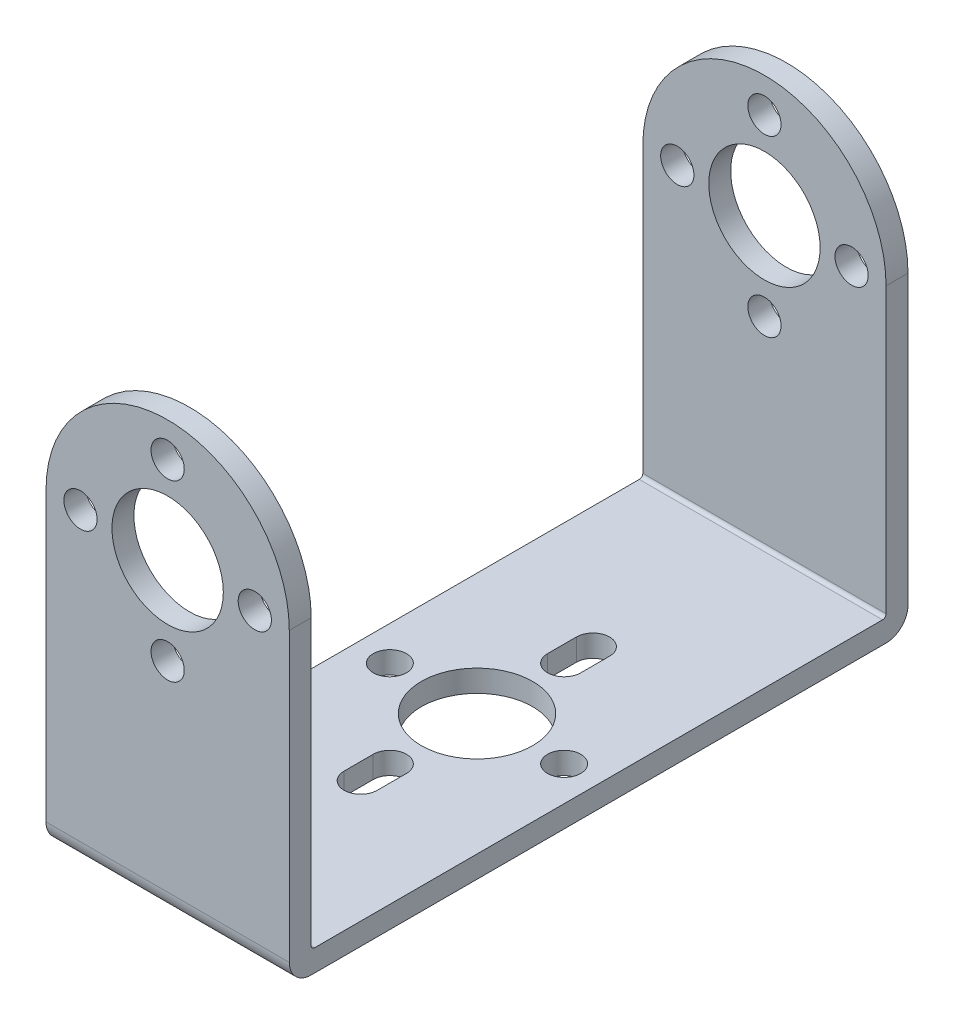
ISO-10303-21;
HEADER;
FILE_DESCRIPTION(('STEP AP214'),'2;1');
FILE_NAME('part.step','',(''),(''),'','','');
FILE_SCHEMA(('AUTOMOTIVE_DESIGN { 1 0 10303 214 1 1 1 1 }'));
ENDSEC;
DATA;
#1=APPLICATION_CONTEXT('core data for automotive mechanical design processes');
#2=APPLICATION_PROTOCOL_DEFINITION('international standard','automotive_design',2000,#1);
#3=PRODUCT_CONTEXT('',#1,'mechanical');
#4=PRODUCT('Part','Part','',(#3));
#5=PRODUCT_RELATED_PRODUCT_CATEGORY('part','',(#4));
#6=PRODUCT_DEFINITION_FORMATION('','',#4);
#7=PRODUCT_DEFINITION_CONTEXT('part definition',#1,'design');
#8=PRODUCT_DEFINITION('design','',#6,#7);
#9=PRODUCT_DEFINITION_SHAPE('','',#8);
#10=(LENGTH_UNIT() NAMED_UNIT(*) SI_UNIT(.MILLI.,.METRE.));
#11=(NAMED_UNIT(*) PLANE_ANGLE_UNIT() SI_UNIT($,.RADIAN.));
#12=(NAMED_UNIT(*) SI_UNIT($,.STERADIAN.) SOLID_ANGLE_UNIT());
#13=UNCERTAINTY_MEASURE_WITH_UNIT(LENGTH_MEASURE(1.E-05),#10,'distance_accuracy_value','');
#14=(GEOMETRIC_REPRESENTATION_CONTEXT(3) GLOBAL_UNCERTAINTY_ASSIGNED_CONTEXT((#13)) GLOBAL_UNIT_ASSIGNED_CONTEXT((#10,
#11,#12)) REPRESENTATION_CONTEXT('',''));
#15=CARTESIAN_POINT('',(0.,0.,0.));
#16=DIRECTION('',(0.,0.,1.));
#17=DIRECTION('',(1.,0.,0.));
#18=AXIS2_PLACEMENT_3D('',#15,#16,#17);
#19=CARTESIAN_POINT('',(17.4752,0.,0.));
#20=DIRECTION('',(0.,0.,-1.));
#21=DIRECTION('',(-1.,0.,0.));
#22=AXIS2_PLACEMENT_3D('',#19,#20,#21);
#23=PLANE('',#22);
#24=CARTESIAN_POINT('',(8.7376,28.4861,0.));
#25=DIRECTION('',(0.,0.,1.));
#26=DIRECTION('',(1.,0.,0.));
#27=AXIS2_PLACEMENT_3D('',#24,#25,#26);
#28=CIRCLE('',#27,1.1938);
#29=CARTESIAN_POINT('',(9.9314,28.4861,0.));
#30=VERTEX_POINT('',#29);
#31=EDGE_CURVE('E298',#30,#30,#28,.T.);
#32=ORIENTED_EDGE('',*,*,#31,.F.);
#33=EDGE_LOOP('',(#32));
#34=FACE_BOUND('',#33,.T.);
#35=CARTESIAN_POINT('',(8.7376,15.9639,0.));
#36=DIRECTION('',(0.,0.,1.));
#37=DIRECTION('',(1.,0.,0.));
#38=AXIS2_PLACEMENT_3D('',#35,#36,#37);
#39=CIRCLE('',#38,1.1938);
#40=CARTESIAN_POINT('',(9.9314,15.9639,0.));
#41=VERTEX_POINT('',#40);
#42=EDGE_CURVE('E311',#41,#41,#39,.T.);
#43=ORIENTED_EDGE('',*,*,#42,.F.);
#44=EDGE_LOOP('',(#43));
#45=FACE_BOUND('',#44,.T.);
#46=CARTESIAN_POINT('',(14.9987,22.225,0.));
#47=DIRECTION('',(0.,0.,1.));
#48=DIRECTION('',(1.,0.,0.));
#49=AXIS2_PLACEMENT_3D('',#46,#47,#48);
#50=CIRCLE('',#49,1.1938);
#51=CARTESIAN_POINT('',(16.1925,22.225,0.));
#52=VERTEX_POINT('',#51);
#53=EDGE_CURVE('E324',#52,#52,#50,.T.);
#54=ORIENTED_EDGE('',*,*,#53,.F.);
#55=EDGE_LOOP('',(#54));
#56=FACE_BOUND('',#55,.T.);
#57=CARTESIAN_POINT('',(2.4765,22.225,0.));
#58=DIRECTION('',(0.,0.,1.));
#59=DIRECTION('',(1.,0.,0.));
#60=AXIS2_PLACEMENT_3D('',#57,#58,#59);
#61=CIRCLE('',#60,1.1938);
#62=CARTESIAN_POINT('',(3.6703,22.225,0.));
#63=VERTEX_POINT('',#62);
#64=EDGE_CURVE('E337',#63,#63,#61,.T.);
#65=ORIENTED_EDGE('',*,*,#64,.F.);
#66=EDGE_LOOP('',(#65));
#67=FACE_BOUND('',#66,.T.);
#68=CARTESIAN_POINT('',(8.7376,22.225,0.));
#69=DIRECTION('',(0.,0.,1.));
#70=DIRECTION('',(1.,0.,0.));
#71=AXIS2_PLACEMENT_3D('',#68,#69,#70);
#72=CIRCLE('',#71,4.0005);
#73=CARTESIAN_POINT('',(12.7381,22.225,0.));
#74=VERTEX_POINT('',#73);
#75=EDGE_CURVE('E350',#74,#74,#72,.T.);
#76=ORIENTED_EDGE('',*,*,#75,.F.);
#77=EDGE_LOOP('',(#76));
#78=FACE_BOUND('',#77,.T.);
#79=DIRECTION('',(0.,-1.,0.));
#80=VECTOR('',#79,1.);
#81=CARTESIAN_POINT('',(0.,0.,0.));
#82=LINE('',#81,#80);
#83=CARTESIAN_POINT('',(0.,22.225,0.));
#84=VERTEX_POINT('',#83);
#85=CARTESIAN_POINT('',(0.,1.5748,0.));
#86=VERTEX_POINT('',#85);
#87=EDGE_CURVE('E402',#84,#86,#82,.T.);
#88=ORIENTED_EDGE('',*,*,#87,.T.);
#89=DIRECTION('',(-1.,0.,0.));
#90=VECTOR('',#89,1.);
#91=CARTESIAN_POINT('',(17.4752,1.5748,0.));
#92=LINE('',#91,#90);
#93=CARTESIAN_POINT('',(17.4752,1.5748,0.));
#94=VERTEX_POINT('',#93);
#95=EDGE_CURVE('E466',#86,#94,#92,.F.);
#96=ORIENTED_EDGE('',*,*,#95,.T.);
#97=DIRECTION('',(0.,-1.,0.));
#98=VECTOR('',#97,1.);
#99=CARTESIAN_POINT('',(17.4752,0.,0.));
#100=LINE('',#99,#98);
#101=CARTESIAN_POINT('',(17.4752,22.225,0.));
#102=VERTEX_POINT('',#101);
#103=EDGE_CURVE('E405',#102,#94,#100,.T.);
#104=ORIENTED_EDGE('',*,*,#103,.F.);
#105=CARTESIAN_POINT('',(8.7376,22.225,0.));
#106=DIRECTION('',(0.,0.,1.));
#107=DIRECTION('',(1.,0.,0.));
#108=AXIS2_PLACEMENT_3D('',#105,#106,#107);
#109=CIRCLE('',#108,8.7376);
#110=EDGE_CURVE('E363',#102,#84,#109,.T.);
#111=ORIENTED_EDGE('',*,*,#110,.T.);
#112=EDGE_LOOP('',(#88,#96,#104,#111));
#113=FACE_BOUND('',#112,.T.);
#114=ADVANCED_FACE('F36',(#34,#45,#56,#67,#78,#113),#23,.F.);
#115=CARTESIAN_POINT('',(17.4752,0.,-44.45));
#116=DIRECTION('',(0.,0.,1.));
#117=DIRECTION('',(1.,0.,0.));
#118=AXIS2_PLACEMENT_3D('',#115,#116,#117);
#119=PLANE('',#118);
#120=CARTESIAN_POINT('',(8.7376,28.4861,-44.45));
#121=DIRECTION('',(0.,0.,1.));
#122=DIRECTION('',(1.,0.,0.));
#123=AXIS2_PLACEMENT_3D('',#120,#121,#122);
#124=CIRCLE('',#123,1.1938);
#125=CARTESIAN_POINT('',(9.9314,28.4861,-44.45));
#126=VERTEX_POINT('',#125);
#127=EDGE_CURVE('E299',#126,#126,#124,.T.);
#128=ORIENTED_EDGE('',*,*,#127,.T.);
#129=EDGE_LOOP('',(#128));
#130=FACE_BOUND('',#129,.T.);
#131=CARTESIAN_POINT('',(8.7376,15.9639,-44.45));
#132=DIRECTION('',(0.,0.,1.));
#133=DIRECTION('',(1.,0.,0.));
#134=AXIS2_PLACEMENT_3D('',#131,#132,#133);
#135=CIRCLE('',#134,1.1938);
#136=CARTESIAN_POINT('',(9.9314,15.9639,-44.45));
#137=VERTEX_POINT('',#136);
#138=EDGE_CURVE('E312',#137,#137,#135,.T.);
#139=ORIENTED_EDGE('',*,*,#138,.T.);
#140=EDGE_LOOP('',(#139));
#141=FACE_BOUND('',#140,.T.);
#142=CARTESIAN_POINT('',(14.9987,22.225,-44.45));
#143=DIRECTION('',(0.,0.,1.));
#144=DIRECTION('',(1.,0.,0.));
#145=AXIS2_PLACEMENT_3D('',#142,#143,#144);
#146=CIRCLE('',#145,1.1938);
#147=CARTESIAN_POINT('',(16.1925,22.225,-44.45));
#148=VERTEX_POINT('',#147);
#149=EDGE_CURVE('E325',#148,#148,#146,.T.);
#150=ORIENTED_EDGE('',*,*,#149,.T.);
#151=EDGE_LOOP('',(#150));
#152=FACE_BOUND('',#151,.T.);
#153=CARTESIAN_POINT('',(2.4765,22.225,-44.45));
#154=DIRECTION('',(0.,0.,1.));
#155=DIRECTION('',(1.,0.,0.));
#156=AXIS2_PLACEMENT_3D('',#153,#154,#155);
#157=CIRCLE('',#156,1.1938);
#158=CARTESIAN_POINT('',(3.6703,22.225,-44.45));
#159=VERTEX_POINT('',#158);
#160=EDGE_CURVE('E338',#159,#159,#157,.T.);
#161=ORIENTED_EDGE('',*,*,#160,.T.);
#162=EDGE_LOOP('',(#161));
#163=FACE_BOUND('',#162,.T.);
#164=CARTESIAN_POINT('',(8.7376,22.225,-44.45));
#165=DIRECTION('',(0.,0.,1.));
#166=DIRECTION('',(1.,0.,0.));
#167=AXIS2_PLACEMENT_3D('',#164,#165,#166);
#168=CIRCLE('',#167,4.0005);
#169=CARTESIAN_POINT('',(12.7381,22.225,-44.45));
#170=VERTEX_POINT('',#169);
#171=EDGE_CURVE('E351',#170,#170,#168,.T.);
#172=ORIENTED_EDGE('',*,*,#171,.T.);
#173=EDGE_LOOP('',(#172));
#174=FACE_BOUND('',#173,.T.);
#175=DIRECTION('',(0.,1.,0.));
#176=VECTOR('',#175,1.);
#177=CARTESIAN_POINT('',(17.4752,0.,-44.45));
#178=LINE('',#177,#176);
#179=CARTESIAN_POINT('',(17.4752,1.5748,-44.45));
#180=VERTEX_POINT('',#179);
#181=CARTESIAN_POINT('',(17.4752,22.225,-44.45));
#182=VERTEX_POINT('',#181);
#183=EDGE_CURVE('E413',#180,#182,#178,.T.);
#184=ORIENTED_EDGE('',*,*,#183,.F.);
#185=DIRECTION('',(-1.,0.,0.));
#186=VECTOR('',#185,1.);
#187=CARTESIAN_POINT('',(17.4752,1.5748,-44.45));
#188=LINE('',#187,#186);
#189=CARTESIAN_POINT('',(0.,1.5748,-44.45));
#190=VERTEX_POINT('',#189);
#191=EDGE_CURVE('E428',#180,#190,#188,.T.);
#192=ORIENTED_EDGE('',*,*,#191,.T.);
#193=DIRECTION('',(0.,1.,0.));
#194=VECTOR('',#193,1.);
#195=CARTESIAN_POINT('',(0.,0.,-44.45));
#196=LINE('',#195,#194);
#197=CARTESIAN_POINT('',(0.,22.225,-44.45));
#198=VERTEX_POINT('',#197);
#199=EDGE_CURVE('E410',#190,#198,#196,.T.);
#200=ORIENTED_EDGE('',*,*,#199,.T.);
#201=CARTESIAN_POINT('',(8.7376,22.225,-44.45));
#202=DIRECTION('',(0.,0.,1.));
#203=DIRECTION('',(1.,0.,0.));
#204=AXIS2_PLACEMENT_3D('',#201,#202,#203);
#205=CIRCLE('',#204,8.7376);
#206=EDGE_CURVE('E364',#182,#198,#205,.T.);
#207=ORIENTED_EDGE('',*,*,#206,.F.);
#208=EDGE_LOOP('',(#184,#192,#200,#207));
#209=FACE_BOUND('',#208,.T.);
#210=ADVANCED_FACE('F524',(#130,#141,#152,#163,#174,#209),#119,.F.);
#211=CARTESIAN_POINT('',(-50.6889122885864,30.9626,-42.8752));
#212=DIRECTION('',(0.,0.,-1.));
#213=DIRECTION('',(0.,1.,0.));
#214=AXIS2_PLACEMENT_3D('',#211,#212,#213);
#215=PLANE('',#214);
#216=CARTESIAN_POINT('',(8.7376,28.4861,-42.8752));
#217=DIRECTION('',(0.,0.,-1.));
#218=DIRECTION('',(0.,1.,0.));
#219=AXIS2_PLACEMENT_3D('',#216,#217,#218);
#220=CIRCLE('',#219,1.1938);
#221=CARTESIAN_POINT('',(8.7376,29.6799,-42.8752));
#222=VERTEX_POINT('',#221);
#223=EDGE_CURVE('E307',#222,#222,#220,.T.);
#224=ORIENTED_EDGE('',*,*,#223,.T.);
#225=EDGE_LOOP('',(#224));
#226=FACE_BOUND('',#225,.T.);
#227=CARTESIAN_POINT('',(8.7376,15.9639,-42.8752));
#228=DIRECTION('',(0.,0.,-1.));
#229=DIRECTION('',(0.,1.,0.));
#230=AXIS2_PLACEMENT_3D('',#227,#228,#229);
#231=CIRCLE('',#230,1.1938);
#232=CARTESIAN_POINT('',(8.7376,17.1577,-42.8752));
#233=VERTEX_POINT('',#232);
#234=EDGE_CURVE('E320',#233,#233,#231,.T.);
#235=ORIENTED_EDGE('',*,*,#234,.T.);
#236=EDGE_LOOP('',(#235));
#237=FACE_BOUND('',#236,.T.);
#238=CARTESIAN_POINT('',(14.9987,22.225,-42.8752));
#239=DIRECTION('',(0.,0.,-1.));
#240=DIRECTION('',(0.,1.,0.));
#241=AXIS2_PLACEMENT_3D('',#238,#239,#240);
#242=CIRCLE('',#241,1.1938);
#243=CARTESIAN_POINT('',(14.9987,23.4188,-42.8752));
#244=VERTEX_POINT('',#243);
#245=EDGE_CURVE('E333',#244,#244,#242,.T.);
#246=ORIENTED_EDGE('',*,*,#245,.T.);
#247=EDGE_LOOP('',(#246));
#248=FACE_BOUND('',#247,.T.);
#249=CARTESIAN_POINT('',(2.4765,22.225,-42.8752));
#250=DIRECTION('',(0.,0.,-1.));
#251=DIRECTION('',(0.,1.,0.));
#252=AXIS2_PLACEMENT_3D('',#249,#250,#251);
#253=CIRCLE('',#252,1.1938);
#254=CARTESIAN_POINT('',(2.4765,23.4188,-42.8752));
#255=VERTEX_POINT('',#254);
#256=EDGE_CURVE('E346',#255,#255,#253,.T.);
#257=ORIENTED_EDGE('',*,*,#256,.T.);
#258=EDGE_LOOP('',(#257));
#259=FACE_BOUND('',#258,.T.);
#260=CARTESIAN_POINT('',(8.7376,22.225,-42.8752));
#261=DIRECTION('',(0.,0.,-1.));
#262=DIRECTION('',(0.,1.,0.));
#263=AXIS2_PLACEMENT_3D('',#260,#261,#262);
#264=CIRCLE('',#263,4.0005);
#265=CARTESIAN_POINT('',(8.7376,26.2255,-42.8752));
#266=VERTEX_POINT('',#265);
#267=EDGE_CURVE('E359',#266,#266,#264,.T.);
#268=ORIENTED_EDGE('',*,*,#267,.T.);
#269=EDGE_LOOP('',(#268));
#270=FACE_BOUND('',#269,.T.);
#271=DIRECTION('',(0.,1.,0.));
#272=VECTOR('',#271,1.);
#273=CARTESIAN_POINT('',(0.,30.9626,-42.8752));
#274=LINE('',#273,#272);
#275=CARTESIAN_POINT('',(0.,1.8288,-42.8752));
#276=VERTEX_POINT('',#275);
#277=CARTESIAN_POINT('',(0.,22.225,-42.8752));
#278=VERTEX_POINT('',#277);
#279=EDGE_CURVE('E398',#276,#278,#274,.T.);
#280=ORIENTED_EDGE('',*,*,#279,.F.);
#281=DIRECTION('',(1.,0.,0.));
#282=VECTOR('',#281,1.);
#283=CARTESIAN_POINT('',(17.4752,1.8288,-42.8752));
#284=LINE('',#283,#282);
#285=CARTESIAN_POINT('',(17.4752,1.8288,-42.8752));
#286=VERTEX_POINT('',#285);
#287=EDGE_CURVE('E469',#276,#286,#284,.T.);
#288=ORIENTED_EDGE('',*,*,#287,.T.);
#289=DIRECTION('',(0.,1.,0.));
#290=VECTOR('',#289,1.);
#291=CARTESIAN_POINT('',(17.4752,30.9626,-42.8752));
#292=LINE('',#291,#290);
#293=CARTESIAN_POINT('',(17.4752,22.225,-42.8752));
#294=VERTEX_POINT('',#293);
#295=EDGE_CURVE('E385',#286,#294,#292,.T.);
#296=ORIENTED_EDGE('',*,*,#295,.T.);
#297=CARTESIAN_POINT('',(8.7376,22.225,-42.8752));
#298=DIRECTION('',(0.,0.,-1.));
#299=DIRECTION('',(0.,1.,0.));
#300=AXIS2_PLACEMENT_3D('',#297,#298,#299);
#301=CIRCLE('',#300,8.7376);
#302=EDGE_CURVE('E375',#278,#294,#301,.T.);
#303=ORIENTED_EDGE('',*,*,#302,.F.);
#304=EDGE_LOOP('',(#280,#288,#296,#303));
#305=FACE_BOUND('',#304,.T.);
#306=ADVANCED_FACE('F535',(#226,#237,#248,#259,#270,#305),#215,.F.);
#307=CARTESIAN_POINT('',(-50.6889122885864,30.9626,-1.5748));
#308=DIRECTION('',(0.,0.,1.));
#309=DIRECTION('',(0.,-1.,0.));
#310=AXIS2_PLACEMENT_3D('',#307,#308,#309);
#311=PLANE('',#310);
#312=CARTESIAN_POINT('',(8.7376,28.4861,-1.5748));
#313=DIRECTION('',(0.,0.,1.));
#314=DIRECTION('',(0.,-1.,0.));
#315=AXIS2_PLACEMENT_3D('',#312,#313,#314);
#316=CIRCLE('',#315,1.1938);
#317=CARTESIAN_POINT('',(8.7376,27.2923,-1.5748));
#318=VERTEX_POINT('',#317);
#319=EDGE_CURVE('E303',#318,#318,#316,.T.);
#320=ORIENTED_EDGE('',*,*,#319,.T.);
#321=EDGE_LOOP('',(#320));
#322=FACE_BOUND('',#321,.T.);
#323=CARTESIAN_POINT('',(8.7376,15.9639,-1.5748));
#324=DIRECTION('',(0.,0.,1.));
#325=DIRECTION('',(0.,-1.,0.));
#326=AXIS2_PLACEMENT_3D('',#323,#324,#325);
#327=CIRCLE('',#326,1.1938);
#328=CARTESIAN_POINT('',(8.7376,14.7701,-1.5748));
#329=VERTEX_POINT('',#328);
#330=EDGE_CURVE('E316',#329,#329,#327,.T.);
#331=ORIENTED_EDGE('',*,*,#330,.T.);
#332=EDGE_LOOP('',(#331));
#333=FACE_BOUND('',#332,.T.);
#334=CARTESIAN_POINT('',(14.9987,22.225,-1.5748));
#335=DIRECTION('',(0.,0.,1.));
#336=DIRECTION('',(0.,-1.,0.));
#337=AXIS2_PLACEMENT_3D('',#334,#335,#336);
#338=CIRCLE('',#337,1.1938);
#339=CARTESIAN_POINT('',(14.9987,21.0312,-1.5748));
#340=VERTEX_POINT('',#339);
#341=EDGE_CURVE('E329',#340,#340,#338,.T.);
#342=ORIENTED_EDGE('',*,*,#341,.T.);
#343=EDGE_LOOP('',(#342));
#344=FACE_BOUND('',#343,.T.);
#345=CARTESIAN_POINT('',(2.4765,22.225,-1.5748));
#346=DIRECTION('',(0.,0.,1.));
#347=DIRECTION('',(0.,-1.,0.));
#348=AXIS2_PLACEMENT_3D('',#345,#346,#347);
#349=CIRCLE('',#348,1.1938);
#350=CARTESIAN_POINT('',(2.4765,21.0312,-1.5748));
#351=VERTEX_POINT('',#350);
#352=EDGE_CURVE('E342',#351,#351,#349,.T.);
#353=ORIENTED_EDGE('',*,*,#352,.T.);
#354=EDGE_LOOP('',(#353));
#355=FACE_BOUND('',#354,.T.);
#356=CARTESIAN_POINT('',(8.7376,22.225,-1.5748));
#357=DIRECTION('',(0.,0.,1.));
#358=DIRECTION('',(0.,-1.,0.));
#359=AXIS2_PLACEMENT_3D('',#356,#357,#358);
#360=CIRCLE('',#359,4.0005);
#361=CARTESIAN_POINT('',(8.7376,18.2245,-1.5748));
#362=VERTEX_POINT('',#361);
#363=EDGE_CURVE('E355',#362,#362,#360,.T.);
#364=ORIENTED_EDGE('',*,*,#363,.T.);
#365=EDGE_LOOP('',(#364));
#366=FACE_BOUND('',#365,.T.);
#367=DIRECTION('',(0.,-1.,0.));
#368=VECTOR('',#367,1.);
#369=CARTESIAN_POINT('',(17.4752,30.9626,-1.5748));
#370=LINE('',#369,#368);
#371=CARTESIAN_POINT('',(17.4752,22.225,-1.5748));
#372=VERTEX_POINT('',#371);
#373=CARTESIAN_POINT('',(17.4752,1.8288,-1.5748));
#374=VERTEX_POINT('',#373);
#375=EDGE_CURVE('E384',#372,#374,#370,.T.);
#376=ORIENTED_EDGE('',*,*,#375,.T.);
#377=DIRECTION('',(1.,0.,0.));
#378=VECTOR('',#377,1.);
#379=CARTESIAN_POINT('',(0.,1.8288,-1.5748));
#380=LINE('',#379,#378);
#381=CARTESIAN_POINT('',(0.,1.8288,-1.5748));
#382=VERTEX_POINT('',#381);
#383=EDGE_CURVE('E52',#374,#382,#380,.F.);
#384=ORIENTED_EDGE('',*,*,#383,.T.);
#385=DIRECTION('',(0.,-1.,0.));
#386=VECTOR('',#385,1.);
#387=CARTESIAN_POINT('',(0.,30.9626,-1.5748));
#388=LINE('',#387,#386);
#389=CARTESIAN_POINT('',(0.,22.225,-1.5748));
#390=VERTEX_POINT('',#389);
#391=EDGE_CURVE('E399',#390,#382,#388,.T.);
#392=ORIENTED_EDGE('',*,*,#391,.F.);
#393=CARTESIAN_POINT('',(8.7376,22.225,-1.5748));
#394=DIRECTION('',(0.,0.,1.));
#395=DIRECTION('',(0.,-1.,0.));
#396=AXIS2_PLACEMENT_3D('',#393,#394,#395);
#397=CIRCLE('',#396,8.7376);
#398=EDGE_CURVE('E416',#372,#390,#397,.T.);
#399=ORIENTED_EDGE('',*,*,#398,.F.);
#400=EDGE_LOOP('',(#376,#384,#392,#399));
#401=FACE_BOUND('',#400,.T.);
#402=ADVANCED_FACE('F502',(#322,#333,#344,#355,#366,#401),#311,.F.);
#403=CARTESIAN_POINT('',(17.4752,0.,0.));
#404=DIRECTION('',(0.,1.,0.));
#405=DIRECTION('',(0.,0.,1.));
#406=AXIS2_PLACEMENT_3D('',#403,#404,#405);
#407=PLANE('',#406);
#408=DIRECTION('',(0.,0.,-1.));
#409=VECTOR('',#408,1.);
#410=CARTESIAN_POINT('',(9.93139999999999,0.,0.));
#411=LINE('',#410,#409);
#412=CARTESIAN_POINT('',(9.93139999999999,0.,-28.4861));
#413=VERTEX_POINT('',#412);
#414=CARTESIAN_POINT('',(9.93139999999999,0.,-30.5562));
#415=VERTEX_POINT('',#414);
#416=EDGE_CURVE('E223',#413,#415,#411,.T.);
#417=ORIENTED_EDGE('',*,*,#416,.T.);
#418=CARTESIAN_POINT('',(8.73759999999999,0.,-30.5562));
#419=DIRECTION('',(0.,1.,0.));
#420=DIRECTION('',(0.,0.,1.));
#421=AXIS2_PLACEMENT_3D('',#418,#419,#420);
#422=CIRCLE('',#421,1.1938);
#423=CARTESIAN_POINT('',(7.54379999999999,0.,-30.5562));
#424=VERTEX_POINT('',#423);
#425=EDGE_CURVE('E227',#415,#424,#422,.T.);
#426=ORIENTED_EDGE('',*,*,#425,.T.);
#427=DIRECTION('',(0.,0.,1.));
#428=VECTOR('',#427,1.);
#429=CARTESIAN_POINT('',(7.54379999999999,0.,0.));
#430=LINE('',#429,#428);
#431=CARTESIAN_POINT('',(7.54379999999999,0.,-28.4861));
#432=VERTEX_POINT('',#431);
#433=EDGE_CURVE('E214',#424,#432,#430,.T.);
#434=ORIENTED_EDGE('',*,*,#433,.T.);
#435=CARTESIAN_POINT('',(8.73759999999999,0.,-28.4861));
#436=DIRECTION('',(0.,1.,0.));
#437=DIRECTION('',(0.,0.,1.));
#438=AXIS2_PLACEMENT_3D('',#435,#436,#437);
#439=CIRCLE('',#438,1.1938);
#440=EDGE_CURVE('E182',#432,#413,#439,.T.);
#441=ORIENTED_EDGE('',*,*,#440,.T.);
#442=EDGE_LOOP('',(#417,#426,#434,#441));
#443=FACE_BOUND('',#442,.T.);
#444=DIRECTION('',(0.,0.,-1.));
#445=VECTOR('',#444,1.);
#446=CARTESIAN_POINT('',(9.93139999999999,0.,0.));
#447=LINE('',#446,#445);
#448=CARTESIAN_POINT('',(9.93139999999999,0.,-13.8684));
#449=VERTEX_POINT('',#448);
#450=CARTESIAN_POINT('',(9.93139999999999,0.,-15.9639));
#451=VERTEX_POINT('',#450);
#452=EDGE_CURVE('E266',#449,#451,#447,.T.);
#453=ORIENTED_EDGE('',*,*,#452,.T.);
#454=CARTESIAN_POINT('',(8.73759999999999,0.,-15.9639));
#455=DIRECTION('',(0.,1.,0.));
#456=DIRECTION('',(0.,0.,1.));
#457=AXIS2_PLACEMENT_3D('',#454,#455,#456);
#458=CIRCLE('',#457,1.1938);
#459=CARTESIAN_POINT('',(7.54379999999999,0.,-15.9639));
#460=VERTEX_POINT('',#459);
#461=EDGE_CURVE('E270',#451,#460,#458,.T.);
#462=ORIENTED_EDGE('',*,*,#461,.T.);
#463=DIRECTION('',(0.,0.,1.));
#464=VECTOR('',#463,1.);
#465=CARTESIAN_POINT('',(7.54379999999999,0.,0.));
#466=LINE('',#465,#464);
#467=CARTESIAN_POINT('',(7.54379999999999,0.,-13.8684));
#468=VERTEX_POINT('',#467);
#469=EDGE_CURVE('E249',#460,#468,#466,.T.);
#470=ORIENTED_EDGE('',*,*,#469,.T.);
#471=CARTESIAN_POINT('',(8.73759999999999,0.,-13.8684));
#472=DIRECTION('',(0.,1.,0.));
#473=DIRECTION('',(0.,0.,1.));
#474=AXIS2_PLACEMENT_3D('',#471,#472,#473);
#475=CIRCLE('',#474,1.1938);
#476=EDGE_CURVE('E262',#468,#449,#475,.T.);
#477=ORIENTED_EDGE('',*,*,#476,.T.);
#478=EDGE_LOOP('',(#453,#462,#470,#477));
#479=FACE_BOUND('',#478,.T.);
#480=CARTESIAN_POINT('',(14.9987,0.,-22.225));
#481=DIRECTION('',(0.,1.,0.));
#482=DIRECTION('',(0.,0.,1.));
#483=AXIS2_PLACEMENT_3D('',#480,#481,#482);
#484=CIRCLE('',#483,1.1938);
#485=CARTESIAN_POINT('',(14.9987,0.,-21.0312));
#486=VERTEX_POINT('',#485);
#487=EDGE_CURVE('E278',#486,#486,#484,.T.);
#488=ORIENTED_EDGE('',*,*,#487,.T.);
#489=EDGE_LOOP('',(#488));
#490=FACE_BOUND('',#489,.T.);
#491=CARTESIAN_POINT('',(2.47649999999999,0.,-22.225));
#492=DIRECTION('',(0.,1.,0.));
#493=DIRECTION('',(0.,0.,1.));
#494=AXIS2_PLACEMENT_3D('',#491,#492,#493);
#495=CIRCLE('',#494,1.1938);
#496=CARTESIAN_POINT('',(2.47649999999999,0.,-21.0312));
#497=VERTEX_POINT('',#496);
#498=EDGE_CURVE('E286',#497,#497,#495,.T.);
#499=ORIENTED_EDGE('',*,*,#498,.T.);
#500=EDGE_LOOP('',(#499));
#501=FACE_BOUND('',#500,.T.);
#502=CARTESIAN_POINT('',(8.73759999999999,0.,-22.225));
#503=DIRECTION('',(0.,1.,0.));
#504=DIRECTION('',(0.,0.,1.));
#505=AXIS2_PLACEMENT_3D('',#502,#503,#504);
#506=CIRCLE('',#505,4.0005);
#507=CARTESIAN_POINT('',(8.73759999999999,0.,-18.2245));
#508=VERTEX_POINT('',#507);
#509=EDGE_CURVE('E294',#508,#508,#506,.T.);
#510=ORIENTED_EDGE('',*,*,#509,.T.);
#511=EDGE_LOOP('',(#510));
#512=FACE_BOUND('',#511,.T.);
#513=DIRECTION('',(0.,0.,-1.));
#514=VECTOR('',#513,1.);
#515=CARTESIAN_POINT('',(0.,0.,0.));
#516=LINE('',#515,#514);
#517=CARTESIAN_POINT('',(0.,0.,-1.5748));
#518=VERTEX_POINT('',#517);
#519=CARTESIAN_POINT('',(0.,0.,-42.8752));
#520=VERTEX_POINT('',#519);
#521=EDGE_CURVE('E420',#518,#520,#516,.T.);
#522=ORIENTED_EDGE('',*,*,#521,.T.);
#523=DIRECTION('',(-1.,0.,0.));
#524=VECTOR('',#523,1.);
#525=CARTESIAN_POINT('',(17.4752,0.,-42.8752));
#526=LINE('',#525,#524);
#527=CARTESIAN_POINT('',(17.4752,0.,-42.8752));
#528=VERTEX_POINT('',#527);
#529=EDGE_CURVE('E457',#520,#528,#526,.F.);
#530=ORIENTED_EDGE('',*,*,#529,.T.);
#531=DIRECTION('',(0.,0.,-1.));
#532=VECTOR('',#531,1.);
#533=CARTESIAN_POINT('',(17.4752,0.,0.));
#534=LINE('',#533,#532);
#535=CARTESIAN_POINT('',(17.4752,0.,-1.5748));
#536=VERTEX_POINT('',#535);
#537=EDGE_CURVE('E409',#536,#528,#534,.T.);
#538=ORIENTED_EDGE('',*,*,#537,.F.);
#539=DIRECTION('',(-1.,0.,0.));
#540=VECTOR('',#539,1.);
#541=CARTESIAN_POINT('',(17.4752,0.,-1.5748));
#542=LINE('',#541,#540);
#543=EDGE_CURVE('E453',#536,#518,#542,.T.);
#544=ORIENTED_EDGE('',*,*,#543,.T.);
#545=EDGE_LOOP('',(#522,#530,#538,#544));
#546=FACE_BOUND('',#545,.T.);
#547=ADVANCED_FACE('F498',(#443,#479,#490,#501,#512,#546),#407,.F.);
#548=CARTESIAN_POINT('',(17.4752,30.9626,0.));
#549=DIRECTION('',(-1.,0.,0.));
#550=DIRECTION('',(0.,0.,1.));
#551=AXIS2_PLACEMENT_3D('',#548,#549,#550);
#552=PLANE('',#551);
#553=ORIENTED_EDGE('',*,*,#537,.T.);
#554=CARTESIAN_POINT('',(17.4752,1.5748,-42.8752));
#555=DIRECTION('',(-1.,0.,0.));
#556=DIRECTION('',(0.,0.,1.));
#557=AXIS2_PLACEMENT_3D('',#554,#555,#556);
#558=CIRCLE('',#557,1.5748);
#559=EDGE_CURVE('E463',#528,#180,#558,.F.);
#560=ORIENTED_EDGE('',*,*,#559,.T.);
#561=ORIENTED_EDGE('',*,*,#183,.T.);
#562=DIRECTION('',(0.,0.,1.));
#563=VECTOR('',#562,1.);
#564=CARTESIAN_POINT('',(17.4752,22.225,-44.45));
#565=LINE('',#564,#563);
#566=EDGE_CURVE('E371',#182,#294,#565,.T.);
#567=ORIENTED_EDGE('',*,*,#566,.T.);
#568=ORIENTED_EDGE('',*,*,#295,.F.);
#569=CARTESIAN_POINT('',(17.4752,1.8288,-42.6212));
#570=DIRECTION('',(-1.,0.,0.));
#571=DIRECTION('',(0.,0.,1.));
#572=AXIS2_PLACEMENT_3D('',#569,#570,#571);
#573=CIRCLE('',#572,0.254);
#574=CARTESIAN_POINT('',(17.4752,1.5748,-42.6212));
#575=VERTEX_POINT('',#574);
#576=EDGE_CURVE('E482',#286,#575,#573,.T.);
#577=ORIENTED_EDGE('',*,*,#576,.T.);
#578=DIRECTION('',(0.,0.,-1.));
#579=VECTOR('',#578,1.);
#580=CARTESIAN_POINT('',(17.4752,1.5748,-1.5748));
#581=LINE('',#580,#579);
#582=CARTESIAN_POINT('',(17.4752,1.5748,-1.8288));
#583=VERTEX_POINT('',#582);
#584=EDGE_CURVE('E389',#583,#575,#581,.T.);
#585=ORIENTED_EDGE('',*,*,#584,.F.);
#586=CARTESIAN_POINT('',(17.4752,1.8288,-1.8288));
#587=DIRECTION('',(-1.,0.,0.));
#588=DIRECTION('',(0.,0.,1.));
#589=AXIS2_PLACEMENT_3D('',#586,#587,#588);
#590=CIRCLE('',#589,0.254);
#591=EDGE_CURVE('E45',#583,#374,#590,.T.);
#592=ORIENTED_EDGE('',*,*,#591,.T.);
#593=ORIENTED_EDGE('',*,*,#375,.F.);
#594=EDGE_CURVE('E376',#372,#102,#565,.T.);
#595=ORIENTED_EDGE('',*,*,#594,.T.);
#596=ORIENTED_EDGE('',*,*,#103,.T.);
#597=CARTESIAN_POINT('',(17.4752,1.5748,-1.5748));
#598=DIRECTION('',(-1.,0.,0.));
#599=DIRECTION('',(0.,0.,1.));
#600=AXIS2_PLACEMENT_3D('',#597,#598,#599);
#601=CIRCLE('',#600,1.5748);
#602=EDGE_CURVE('E460',#94,#536,#601,.F.);
#603=ORIENTED_EDGE('',*,*,#602,.T.);
#604=EDGE_LOOP('',(#553,#560,#561,#567,#568,#577,#585,#592,#593,#595,#596,#603));
#605=FACE_BOUND('',#604,.T.);
#606=ADVANCED_FACE('F501',(#605),#552,.F.);
#607=CARTESIAN_POINT('',(0.,30.9626,0.));
#608=DIRECTION('',(-1.,0.,0.));
#609=DIRECTION('',(0.,0.,1.));
#610=AXIS2_PLACEMENT_3D('',#607,#608,#609);
#611=PLANE('',#610);
#612=ORIENTED_EDGE('',*,*,#199,.F.);
#613=CARTESIAN_POINT('',(0.,1.5748,-42.8752));
#614=DIRECTION('',(-1.,0.,0.));
#615=DIRECTION('',(0.,0.,1.));
#616=AXIS2_PLACEMENT_3D('',#613,#614,#615);
#617=CIRCLE('',#616,1.5748);
#618=EDGE_CURVE('E450',#190,#520,#617,.T.);
#619=ORIENTED_EDGE('',*,*,#618,.T.);
#620=ORIENTED_EDGE('',*,*,#521,.F.);
#621=CARTESIAN_POINT('',(0.,1.5748,-1.5748));
#622=DIRECTION('',(-1.,0.,0.));
#623=DIRECTION('',(0.,0.,1.));
#624=AXIS2_PLACEMENT_3D('',#621,#622,#623);
#625=CIRCLE('',#624,1.5748);
#626=EDGE_CURVE('E447',#518,#86,#625,.T.);
#627=ORIENTED_EDGE('',*,*,#626,.T.);
#628=ORIENTED_EDGE('',*,*,#87,.F.);
#629=DIRECTION('',(0.,0.,1.));
#630=VECTOR('',#629,1.);
#631=CARTESIAN_POINT('',(0.,22.225,-44.45));
#632=LINE('',#631,#630);
#633=EDGE_CURVE('E368',#390,#84,#632,.T.);
#634=ORIENTED_EDGE('',*,*,#633,.F.);
#635=ORIENTED_EDGE('',*,*,#391,.T.);
#636=CARTESIAN_POINT('',(0.,1.8288,-1.8288));
#637=DIRECTION('',(-1.,0.,0.));
#638=DIRECTION('',(0.,0.,1.));
#639=AXIS2_PLACEMENT_3D('',#636,#637,#638);
#640=CIRCLE('',#639,0.254);
#641=CARTESIAN_POINT('',(0.,1.5748,-1.8288));
#642=VERTEX_POINT('',#641);
#643=EDGE_CURVE('E12',#382,#642,#640,.F.);
#644=ORIENTED_EDGE('',*,*,#643,.T.);
#645=DIRECTION('',(0.,0.,-1.));
#646=VECTOR('',#645,1.);
#647=CARTESIAN_POINT('',(0.,1.5748,-1.5748));
#648=LINE('',#647,#646);
#649=CARTESIAN_POINT('',(0.,1.5748,-42.6212));
#650=VERTEX_POINT('',#649);
#651=EDGE_CURVE('E388',#642,#650,#648,.T.);
#652=ORIENTED_EDGE('',*,*,#651,.T.);
#653=CARTESIAN_POINT('',(0.,1.8288,-42.6212));
#654=DIRECTION('',(-1.,0.,0.));
#655=DIRECTION('',(0.,0.,1.));
#656=AXIS2_PLACEMENT_3D('',#653,#654,#655);
#657=CIRCLE('',#656,0.254);
#658=EDGE_CURVE('E485',#650,#276,#657,.F.);
#659=ORIENTED_EDGE('',*,*,#658,.T.);
#660=ORIENTED_EDGE('',*,*,#279,.T.);
#661=EDGE_CURVE('E377',#198,#278,#632,.T.);
#662=ORIENTED_EDGE('',*,*,#661,.F.);
#663=EDGE_LOOP('',(#612,#619,#620,#627,#628,#634,#635,#644,#652,#659,#660,#662));
#664=FACE_BOUND('',#663,.T.);
#665=ADVANCED_FACE('F530',(#664),#611,.T.);
#666=CARTESIAN_POINT('',(-50.6889122885864,1.5748,-1.5748));
#667=DIRECTION('',(0.,-1.,0.));
#668=DIRECTION('',(0.,0.,-1.));
#669=AXIS2_PLACEMENT_3D('',#666,#667,#668);
#670=PLANE('',#669);
#671=DIRECTION('',(0.,0.,1.));
#672=VECTOR('',#671,1.);
#673=CARTESIAN_POINT('',(7.54379999999999,1.5748,-30.5562));
#674=LINE('',#673,#672);
#675=CARTESIAN_POINT('',(7.5438,1.5748,-30.5562));
#676=VERTEX_POINT('',#675);
#677=CARTESIAN_POINT('',(7.54379999999999,1.5748,-28.4861));
#678=VERTEX_POINT('',#677);
#679=EDGE_CURVE('E191',#676,#678,#674,.T.);
#680=ORIENTED_EDGE('',*,*,#679,.F.);
#681=CARTESIAN_POINT('',(8.73759999999999,1.5748,-30.5562));
#682=DIRECTION('',(0.,1.,0.));
#683=DIRECTION('',(0.,0.,1.));
#684=AXIS2_PLACEMENT_3D('',#681,#682,#683);
#685=CIRCLE('',#684,1.1938);
#686=CARTESIAN_POINT('',(9.93139999999999,1.5748,-30.5562));
#687=VERTEX_POINT('',#686);
#688=EDGE_CURVE('E197',#687,#676,#685,.T.);
#689=ORIENTED_EDGE('',*,*,#688,.F.);
#690=DIRECTION('',(0.,0.,-1.));
#691=VECTOR('',#690,1.);
#692=CARTESIAN_POINT('',(9.93139999999999,1.5748,-30.5562));
#693=LINE('',#692,#691);
#694=CARTESIAN_POINT('',(9.93139999999999,1.5748,-28.4861));
#695=VERTEX_POINT('',#694);
#696=EDGE_CURVE('E202',#695,#687,#693,.T.);
#697=ORIENTED_EDGE('',*,*,#696,.F.);
#698=CARTESIAN_POINT('',(8.73759999999999,1.5748,-28.4861));
#699=DIRECTION('',(0.,1.,0.));
#700=DIRECTION('',(0.,0.,1.));
#701=AXIS2_PLACEMENT_3D('',#698,#699,#700);
#702=CIRCLE('',#701,1.1938);
#703=EDGE_CURVE('E179',#678,#695,#702,.T.);
#704=ORIENTED_EDGE('',*,*,#703,.F.);
#705=EDGE_LOOP('',(#680,#689,#697,#704));
#706=FACE_BOUND('',#705,.T.);
#707=DIRECTION('',(0.,0.,1.));
#708=VECTOR('',#707,1.);
#709=CARTESIAN_POINT('',(7.54379999999999,1.5748,-15.9639));
#710=LINE('',#709,#708);
#711=CARTESIAN_POINT('',(7.5438,1.5748,-15.9639));
#712=VERTEX_POINT('',#711);
#713=CARTESIAN_POINT('',(7.54379999999999,1.5748,-13.8684));
#714=VERTEX_POINT('',#713);
#715=EDGE_CURVE('E233',#712,#714,#710,.T.);
#716=ORIENTED_EDGE('',*,*,#715,.F.);
#717=CARTESIAN_POINT('',(8.73759999999999,1.5748,-15.9639));
#718=DIRECTION('',(0.,1.,0.));
#719=DIRECTION('',(0.,0.,1.));
#720=AXIS2_PLACEMENT_3D('',#717,#718,#719);
#721=CIRCLE('',#720,1.1938);
#722=CARTESIAN_POINT('',(9.93139999999999,1.5748,-15.9639));
#723=VERTEX_POINT('',#722);
#724=EDGE_CURVE('E231',#723,#712,#721,.T.);
#725=ORIENTED_EDGE('',*,*,#724,.F.);
#726=DIRECTION('',(0.,0.,-1.));
#727=VECTOR('',#726,1.);
#728=CARTESIAN_POINT('',(9.93139999999999,1.5748,-15.9639));
#729=LINE('',#728,#727);
#730=CARTESIAN_POINT('',(9.93139999999999,1.5748,-13.8684));
#731=VERTEX_POINT('',#730);
#732=EDGE_CURVE('E241',#731,#723,#729,.T.);
#733=ORIENTED_EDGE('',*,*,#732,.F.);
#734=CARTESIAN_POINT('',(8.73759999999999,1.5748,-13.8684));
#735=DIRECTION('',(0.,1.,0.));
#736=DIRECTION('',(0.,0.,1.));
#737=AXIS2_PLACEMENT_3D('',#734,#735,#736);
#738=CIRCLE('',#737,1.1938);
#739=EDGE_CURVE('E237',#714,#731,#738,.T.);
#740=ORIENTED_EDGE('',*,*,#739,.F.);
#741=EDGE_LOOP('',(#716,#725,#733,#740));
#742=FACE_BOUND('',#741,.T.);
#743=CARTESIAN_POINT('',(14.9987,1.5748,-22.225));
#744=DIRECTION('',(0.,1.,0.));
#745=DIRECTION('',(0.,0.,1.));
#746=AXIS2_PLACEMENT_3D('',#743,#744,#745);
#747=CIRCLE('',#746,1.1938);
#748=CARTESIAN_POINT('',(14.9987,1.5748,-21.0312));
#749=VERTEX_POINT('',#748);
#750=EDGE_CURVE('E274',#749,#749,#747,.T.);
#751=ORIENTED_EDGE('',*,*,#750,.F.);
#752=EDGE_LOOP('',(#751));
#753=FACE_BOUND('',#752,.T.);
#754=CARTESIAN_POINT('',(2.47649999999999,1.5748,-22.225));
#755=DIRECTION('',(0.,1.,0.));
#756=DIRECTION('',(0.,0.,1.));
#757=AXIS2_PLACEMENT_3D('',#754,#755,#756);
#758=CIRCLE('',#757,1.1938);
#759=CARTESIAN_POINT('',(2.47649999999999,1.5748,-21.0312));
#760=VERTEX_POINT('',#759);
#761=EDGE_CURVE('E282',#760,#760,#758,.T.);
#762=ORIENTED_EDGE('',*,*,#761,.F.);
#763=EDGE_LOOP('',(#762));
#764=FACE_BOUND('',#763,.T.);
#765=CARTESIAN_POINT('',(8.73759999999999,1.5748,-22.225));
#766=DIRECTION('',(0.,1.,0.));
#767=DIRECTION('',(0.,0.,1.));
#768=AXIS2_PLACEMENT_3D('',#765,#766,#767);
#769=CIRCLE('',#768,4.0005);
#770=CARTESIAN_POINT('',(8.73759999999999,1.5748,-18.2245));
#771=VERTEX_POINT('',#770);
#772=EDGE_CURVE('E290',#771,#771,#769,.T.);
#773=ORIENTED_EDGE('',*,*,#772,.F.);
#774=EDGE_LOOP('',(#773));
#775=FACE_BOUND('',#774,.T.);
#776=ORIENTED_EDGE('',*,*,#584,.T.);
#777=DIRECTION('',(1.,0.,0.));
#778=VECTOR('',#777,1.);
#779=CARTESIAN_POINT('',(0.,1.5748,-42.6212));
#780=LINE('',#779,#778);
#781=EDGE_CURVE('E477',#575,#650,#780,.F.);
#782=ORIENTED_EDGE('',*,*,#781,.T.);
#783=ORIENTED_EDGE('',*,*,#651,.F.);
#784=DIRECTION('',(1.,0.,0.));
#785=VECTOR('',#784,1.);
#786=CARTESIAN_POINT('',(17.4752,1.5748,-1.8288));
#787=LINE('',#786,#785);
#788=EDGE_CURVE('E473',#642,#583,#787,.T.);
#789=ORIENTED_EDGE('',*,*,#788,.T.);
#790=EDGE_LOOP('',(#776,#782,#783,#789));
#791=FACE_BOUND('',#790,.T.);
#792=ADVANCED_FACE('F199',(#706,#742,#753,#764,#775,#791),#670,.F.);
#793=CARTESIAN_POINT('',(8.7376,22.225,-44.45));
#794=DIRECTION('',(0.,0.,1.));
#795=DIRECTION('',(1.,0.,0.));
#796=AXIS2_PLACEMENT_3D('',#793,#794,#795);
#797=CYLINDRICAL_SURFACE('',#796,8.7376);
#798=ORIENTED_EDGE('',*,*,#594,.F.);
#799=ORIENTED_EDGE('',*,*,#398,.T.);
#800=ORIENTED_EDGE('',*,*,#633,.T.);
#801=ORIENTED_EDGE('',*,*,#110,.F.);
#802=EDGE_LOOP('',(#798,#799,#800,#801));
#803=FACE_BOUND('',#802,.T.);
#804=ADVANCED_FACE('F550',(#803),#797,.T.);
#805=ORIENTED_EDGE('',*,*,#206,.T.);
#806=ORIENTED_EDGE('',*,*,#661,.T.);
#807=ORIENTED_EDGE('',*,*,#302,.T.);
#808=ORIENTED_EDGE('',*,*,#566,.F.);
#809=EDGE_LOOP('',(#805,#806,#807,#808));
#810=FACE_BOUND('',#809,.T.);
#811=ADVANCED_FACE('F528',(#810),#797,.T.);
#812=CARTESIAN_POINT('',(8.7376,22.225,-44.45));
#813=DIRECTION('',(0.,0.,1.));
#814=DIRECTION('',(1.,0.,0.));
#815=AXIS2_PLACEMENT_3D('',#812,#813,#814);
#816=CYLINDRICAL_SURFACE('',#815,4.0005);
#817=ORIENTED_EDGE('',*,*,#75,.T.);
#818=EDGE_LOOP('',(#817));
#819=FACE_BOUND('',#818,.T.);
#820=ORIENTED_EDGE('',*,*,#363,.F.);
#821=EDGE_LOOP('',(#820));
#822=FACE_BOUND('',#821,.T.);
#823=ADVANCED_FACE('F589',(#819,#822),#816,.F.);
#824=ORIENTED_EDGE('',*,*,#171,.F.);
#825=EDGE_LOOP('',(#824));
#826=FACE_BOUND('',#825,.T.);
#827=ORIENTED_EDGE('',*,*,#267,.F.);
#828=EDGE_LOOP('',(#827));
#829=FACE_BOUND('',#828,.T.);
#830=ADVANCED_FACE('F590',(#826,#829),#816,.F.);
#831=CARTESIAN_POINT('',(2.4765,22.225,-44.45));
#832=DIRECTION('',(0.,0.,1.));
#833=DIRECTION('',(1.,0.,0.));
#834=AXIS2_PLACEMENT_3D('',#831,#832,#833);
#835=CYLINDRICAL_SURFACE('',#834,1.1938);
#836=ORIENTED_EDGE('',*,*,#64,.T.);
#837=EDGE_LOOP('',(#836));
#838=FACE_BOUND('',#837,.T.);
#839=ORIENTED_EDGE('',*,*,#352,.F.);
#840=EDGE_LOOP('',(#839));
#841=FACE_BOUND('',#840,.T.);
#842=ADVANCED_FACE('F593',(#838,#841),#835,.F.);
#843=ORIENTED_EDGE('',*,*,#160,.F.);
#844=EDGE_LOOP('',(#843));
#845=FACE_BOUND('',#844,.T.);
#846=ORIENTED_EDGE('',*,*,#256,.F.);
#847=EDGE_LOOP('',(#846));
#848=FACE_BOUND('',#847,.T.);
#849=ADVANCED_FACE('F595',(#845,#848),#835,.F.);
#850=CARTESIAN_POINT('',(14.9987,22.225,-44.45));
#851=DIRECTION('',(0.,0.,1.));
#852=DIRECTION('',(1.,0.,0.));
#853=AXIS2_PLACEMENT_3D('',#850,#851,#852);
#854=CYLINDRICAL_SURFACE('',#853,1.1938);
#855=ORIENTED_EDGE('',*,*,#53,.T.);
#856=EDGE_LOOP('',(#855));
#857=FACE_BOUND('',#856,.T.);
#858=ORIENTED_EDGE('',*,*,#341,.F.);
#859=EDGE_LOOP('',(#858));
#860=FACE_BOUND('',#859,.T.);
#861=ADVANCED_FACE('F598',(#857,#860),#854,.F.);
#862=ORIENTED_EDGE('',*,*,#149,.F.);
#863=EDGE_LOOP('',(#862));
#864=FACE_BOUND('',#863,.T.);
#865=ORIENTED_EDGE('',*,*,#245,.F.);
#866=EDGE_LOOP('',(#865));
#867=FACE_BOUND('',#866,.T.);
#868=ADVANCED_FACE('F600',(#864,#867),#854,.F.);
#869=CARTESIAN_POINT('',(8.7376,15.9639,-44.45));
#870=DIRECTION('',(0.,0.,1.));
#871=DIRECTION('',(1.,0.,0.));
#872=AXIS2_PLACEMENT_3D('',#869,#870,#871);
#873=CYLINDRICAL_SURFACE('',#872,1.1938);
#874=ORIENTED_EDGE('',*,*,#42,.T.);
#875=EDGE_LOOP('',(#874));
#876=FACE_BOUND('',#875,.T.);
#877=ORIENTED_EDGE('',*,*,#330,.F.);
#878=EDGE_LOOP('',(#877));
#879=FACE_BOUND('',#878,.T.);
#880=ADVANCED_FACE('F603',(#876,#879),#873,.F.);
#881=ORIENTED_EDGE('',*,*,#138,.F.);
#882=EDGE_LOOP('',(#881));
#883=FACE_BOUND('',#882,.T.);
#884=ORIENTED_EDGE('',*,*,#234,.F.);
#885=EDGE_LOOP('',(#884));
#886=FACE_BOUND('',#885,.T.);
#887=ADVANCED_FACE('F605',(#883,#886),#873,.F.);
#888=CARTESIAN_POINT('',(8.7376,28.4861,-44.45));
#889=DIRECTION('',(0.,0.,1.));
#890=DIRECTION('',(1.,0.,0.));
#891=AXIS2_PLACEMENT_3D('',#888,#889,#890);
#892=CYLINDRICAL_SURFACE('',#891,1.1938);
#893=ORIENTED_EDGE('',*,*,#31,.T.);
#894=EDGE_LOOP('',(#893));
#895=FACE_BOUND('',#894,.T.);
#896=ORIENTED_EDGE('',*,*,#319,.F.);
#897=EDGE_LOOP('',(#896));
#898=FACE_BOUND('',#897,.T.);
#899=ADVANCED_FACE('F608',(#895,#898),#892,.F.);
#900=ORIENTED_EDGE('',*,*,#127,.F.);
#901=EDGE_LOOP('',(#900));
#902=FACE_BOUND('',#901,.T.);
#903=ORIENTED_EDGE('',*,*,#223,.F.);
#904=EDGE_LOOP('',(#903));
#905=FACE_BOUND('',#904,.T.);
#906=ADVANCED_FACE('F610',(#902,#905),#892,.F.);
#907=CARTESIAN_POINT('',(8.73759999999999,-15.9004,-22.225));
#908=DIRECTION('',(0.,1.,0.));
#909=DIRECTION('',(0.,0.,1.));
#910=AXIS2_PLACEMENT_3D('',#907,#908,#909);
#911=CYLINDRICAL_SURFACE('',#910,4.0005);
#912=ORIENTED_EDGE('',*,*,#772,.T.);
#913=EDGE_LOOP('',(#912));
#914=FACE_BOUND('',#913,.T.);
#915=ORIENTED_EDGE('',*,*,#509,.F.);
#916=EDGE_LOOP('',(#915));
#917=FACE_BOUND('',#916,.T.);
#918=ADVANCED_FACE('F613',(#914,#917),#911,.F.);
#919=CARTESIAN_POINT('',(2.47649999999999,-15.9004,-22.225));
#920=DIRECTION('',(0.,1.,0.));
#921=DIRECTION('',(0.,0.,1.));
#922=AXIS2_PLACEMENT_3D('',#919,#920,#921);
#923=CYLINDRICAL_SURFACE('',#922,1.1938);
#924=ORIENTED_EDGE('',*,*,#761,.T.);
#925=EDGE_LOOP('',(#924));
#926=FACE_BOUND('',#925,.T.);
#927=ORIENTED_EDGE('',*,*,#498,.F.);
#928=EDGE_LOOP('',(#927));
#929=FACE_BOUND('',#928,.T.);
#930=ADVANCED_FACE('F617',(#926,#929),#923,.F.);
#931=CARTESIAN_POINT('',(14.9987,-15.9004,-22.225));
#932=DIRECTION('',(0.,1.,0.));
#933=DIRECTION('',(0.,0.,1.));
#934=AXIS2_PLACEMENT_3D('',#931,#932,#933);
#935=CYLINDRICAL_SURFACE('',#934,1.1938);
#936=ORIENTED_EDGE('',*,*,#750,.T.);
#937=EDGE_LOOP('',(#936));
#938=FACE_BOUND('',#937,.T.);
#939=ORIENTED_EDGE('',*,*,#487,.F.);
#940=EDGE_LOOP('',(#939));
#941=FACE_BOUND('',#940,.T.);
#942=ADVANCED_FACE('F621',(#938,#941),#935,.F.);
#943=CARTESIAN_POINT('',(8.73759999999999,-15.9004,-15.9639));
#944=DIRECTION('',(0.,1.,0.));
#945=DIRECTION('',(0.,0.,1.));
#946=AXIS2_PLACEMENT_3D('',#943,#944,#945);
#947=CYLINDRICAL_SURFACE('',#946,1.1938);
#948=DIRECTION('',(0.,1.,0.));
#949=VECTOR('',#948,1.);
#950=CARTESIAN_POINT('',(9.93139999999999,-15.9004,-15.9639));
#951=LINE('',#950,#949);
#952=EDGE_CURVE('E246',#451,#723,#951,.T.);
#953=ORIENTED_EDGE('',*,*,#952,.T.);
#954=ORIENTED_EDGE('',*,*,#724,.T.);
#955=DIRECTION('',(0.,1.,0.));
#956=VECTOR('',#955,1.);
#957=CARTESIAN_POINT('',(7.54379999999999,-15.9004,-15.9639));
#958=LINE('',#957,#956);
#959=EDGE_CURVE('E245',#460,#712,#958,.T.);
#960=ORIENTED_EDGE('',*,*,#959,.F.);
#961=ORIENTED_EDGE('',*,*,#461,.F.);
#962=EDGE_LOOP('',(#953,#954,#960,#961));
#963=FACE_BOUND('',#962,.T.);
#964=ADVANCED_FACE('F625',(#963),#947,.F.);
#965=CARTESIAN_POINT('',(9.93139999999999,-15.9004,-15.9639));
#966=DIRECTION('',(1.,0.,0.));
#967=DIRECTION('',(0.,0.,-1.));
#968=AXIS2_PLACEMENT_3D('',#965,#966,#967);
#969=PLANE('',#968);
#970=DIRECTION('',(0.,1.,0.));
#971=VECTOR('',#970,1.);
#972=CARTESIAN_POINT('',(9.93139999999999,-15.9004,-13.8684));
#973=LINE('',#972,#971);
#974=EDGE_CURVE('E250',#449,#731,#973,.T.);
#975=ORIENTED_EDGE('',*,*,#974,.T.);
#976=ORIENTED_EDGE('',*,*,#732,.T.);
#977=ORIENTED_EDGE('',*,*,#952,.F.);
#978=ORIENTED_EDGE('',*,*,#452,.F.);
#979=EDGE_LOOP('',(#975,#976,#977,#978));
#980=FACE_BOUND('',#979,.T.);
#981=ADVANCED_FACE('F629',(#980),#969,.F.);
#982=CARTESIAN_POINT('',(8.73759999999999,-15.9004,-13.8684));
#983=DIRECTION('',(0.,1.,0.));
#984=DIRECTION('',(0.,0.,1.));
#985=AXIS2_PLACEMENT_3D('',#982,#983,#984);
#986=CYLINDRICAL_SURFACE('',#985,1.1938);
#987=DIRECTION('',(0.,1.,0.));
#988=VECTOR('',#987,1.);
#989=CARTESIAN_POINT('',(7.54379999999999,-15.9004,-13.8684));
#990=LINE('',#989,#988);
#991=EDGE_CURVE('E253',#468,#714,#990,.T.);
#992=ORIENTED_EDGE('',*,*,#991,.T.);
#993=ORIENTED_EDGE('',*,*,#739,.T.);
#994=ORIENTED_EDGE('',*,*,#974,.F.);
#995=ORIENTED_EDGE('',*,*,#476,.F.);
#996=EDGE_LOOP('',(#992,#993,#994,#995));
#997=FACE_BOUND('',#996,.T.);
#998=ADVANCED_FACE('F634',(#997),#986,.F.);
#999=CARTESIAN_POINT('',(7.54379999999999,-15.9004,-15.9639));
#1000=DIRECTION('',(-1.,0.,0.));
#1001=DIRECTION('',(0.,0.,1.));
#1002=AXIS2_PLACEMENT_3D('',#999,#1000,#1001);
#1003=PLANE('',#1002);
#1004=ORIENTED_EDGE('',*,*,#959,.T.);
#1005=ORIENTED_EDGE('',*,*,#715,.T.);
#1006=ORIENTED_EDGE('',*,*,#991,.F.);
#1007=ORIENTED_EDGE('',*,*,#469,.F.);
#1008=EDGE_LOOP('',(#1004,#1005,#1006,#1007));
#1009=FACE_BOUND('',#1008,.T.);
#1010=ADVANCED_FACE('F631',(#1009),#1003,.F.);
#1011=CARTESIAN_POINT('',(8.73759999999999,-15.9004,-30.5562));
#1012=DIRECTION('',(0.,1.,0.));
#1013=DIRECTION('',(0.,0.,1.));
#1014=AXIS2_PLACEMENT_3D('',#1011,#1012,#1013);
#1015=CYLINDRICAL_SURFACE('',#1014,1.1938);
#1016=DIRECTION('',(0.,1.,0.));
#1017=VECTOR('',#1016,1.);
#1018=CARTESIAN_POINT('',(9.93139999999999,-15.9004,-30.5562));
#1019=LINE('',#1018,#1017);
#1020=EDGE_CURVE('E211',#415,#687,#1019,.T.);
#1021=ORIENTED_EDGE('',*,*,#1020,.T.);
#1022=ORIENTED_EDGE('',*,*,#688,.T.);
#1023=DIRECTION('',(0.,1.,0.));
#1024=VECTOR('',#1023,1.);
#1025=CARTESIAN_POINT('',(7.54379999999999,-15.9004,-30.5562));
#1026=LINE('',#1025,#1024);
#1027=EDGE_CURVE('E187',#424,#676,#1026,.T.);
#1028=ORIENTED_EDGE('',*,*,#1027,.F.);
#1029=ORIENTED_EDGE('',*,*,#425,.F.);
#1030=EDGE_LOOP('',(#1021,#1022,#1028,#1029));
#1031=FACE_BOUND('',#1030,.T.);
#1032=ADVANCED_FACE('F493',(#1031),#1015,.F.);
#1033=CARTESIAN_POINT('',(9.93139999999999,-15.9004,-30.5562));
#1034=DIRECTION('',(1.,0.,0.));
#1035=DIRECTION('',(0.,0.,-1.));
#1036=AXIS2_PLACEMENT_3D('',#1033,#1034,#1035);
#1037=PLANE('',#1036);
#1038=DIRECTION('',(0.,1.,0.));
#1039=VECTOR('',#1038,1.);
#1040=CARTESIAN_POINT('',(9.93139999999999,-15.9004,-28.4861));
#1041=LINE('',#1040,#1039);
#1042=EDGE_CURVE('E186',#413,#695,#1041,.T.);
#1043=ORIENTED_EDGE('',*,*,#1042,.T.);
#1044=ORIENTED_EDGE('',*,*,#696,.T.);
#1045=ORIENTED_EDGE('',*,*,#1020,.F.);
#1046=ORIENTED_EDGE('',*,*,#416,.F.);
#1047=EDGE_LOOP('',(#1043,#1044,#1045,#1046));
#1048=FACE_BOUND('',#1047,.T.);
#1049=ADVANCED_FACE('F496',(#1048),#1037,.F.);
#1050=CARTESIAN_POINT('',(8.73759999999999,-15.9004,-28.4861));
#1051=DIRECTION('',(0.,1.,0.));
#1052=DIRECTION('',(0.,0.,1.));
#1053=AXIS2_PLACEMENT_3D('',#1050,#1051,#1052);
#1054=CYLINDRICAL_SURFACE('',#1053,1.1938);
#1055=DIRECTION('',(0.,1.,0.));
#1056=VECTOR('',#1055,1.);
#1057=CARTESIAN_POINT('',(7.54379999999999,-15.9004,-28.4861));
#1058=LINE('',#1057,#1056);
#1059=EDGE_CURVE('E174',#432,#678,#1058,.T.);
#1060=ORIENTED_EDGE('',*,*,#1059,.T.);
#1061=ORIENTED_EDGE('',*,*,#703,.T.);
#1062=ORIENTED_EDGE('',*,*,#1042,.F.);
#1063=ORIENTED_EDGE('',*,*,#440,.F.);
#1064=EDGE_LOOP('',(#1060,#1061,#1062,#1063));
#1065=FACE_BOUND('',#1064,.T.);
#1066=ADVANCED_FACE('F176',(#1065),#1054,.F.);
#1067=CARTESIAN_POINT('',(7.54379999999999,-15.9004,-30.5562));
#1068=DIRECTION('',(-1.,0.,0.));
#1069=DIRECTION('',(0.,0.,1.));
#1070=AXIS2_PLACEMENT_3D('',#1067,#1068,#1069);
#1071=PLANE('',#1070);
#1072=ORIENTED_EDGE('',*,*,#1027,.T.);
#1073=ORIENTED_EDGE('',*,*,#679,.T.);
#1074=ORIENTED_EDGE('',*,*,#1059,.F.);
#1075=ORIENTED_EDGE('',*,*,#433,.F.);
#1076=EDGE_LOOP('',(#1072,#1073,#1074,#1075));
#1077=FACE_BOUND('',#1076,.T.);
#1078=ADVANCED_FACE('F192',(#1077),#1071,.F.);
#1079=CARTESIAN_POINT('',(17.4752,1.5748,-42.8752));
#1080=DIRECTION('',(-1.,0.,0.));
#1081=DIRECTION('',(0.,0.,1.));
#1082=AXIS2_PLACEMENT_3D('',#1079,#1080,#1081);
#1083=CYLINDRICAL_SURFACE('',#1082,1.5748);
#1084=ORIENTED_EDGE('',*,*,#559,.F.);
#1085=ORIENTED_EDGE('',*,*,#529,.F.);
#1086=ORIENTED_EDGE('',*,*,#618,.F.);
#1087=ORIENTED_EDGE('',*,*,#191,.F.);
#1088=EDGE_LOOP('',(#1084,#1085,#1086,#1087));
#1089=FACE_BOUND('',#1088,.T.);
#1090=ADVANCED_FACE('F518',(#1089),#1083,.T.);
#1091=CARTESIAN_POINT('',(17.4752,1.5748,-1.5748));
#1092=DIRECTION('',(-1.,0.,0.));
#1093=DIRECTION('',(0.,0.,1.));
#1094=AXIS2_PLACEMENT_3D('',#1091,#1092,#1093);
#1095=CYLINDRICAL_SURFACE('',#1094,1.5748);
#1096=ORIENTED_EDGE('',*,*,#602,.F.);
#1097=ORIENTED_EDGE('',*,*,#95,.F.);
#1098=ORIENTED_EDGE('',*,*,#626,.F.);
#1099=ORIENTED_EDGE('',*,*,#543,.F.);
#1100=EDGE_LOOP('',(#1096,#1097,#1098,#1099));
#1101=FACE_BOUND('',#1100,.T.);
#1102=ADVANCED_FACE('F556',(#1101),#1095,.T.);
#1103=CARTESIAN_POINT('',(-50.6889122885864,1.8288,-42.6212));
#1104=DIRECTION('',(-1.,0.,0.));
#1105=DIRECTION('',(0.,0.,1.));
#1106=AXIS2_PLACEMENT_3D('',#1103,#1104,#1105);
#1107=CYLINDRICAL_SURFACE('',#1106,0.254);
#1108=ORIENTED_EDGE('',*,*,#658,.F.);
#1109=ORIENTED_EDGE('',*,*,#781,.F.);
#1110=ORIENTED_EDGE('',*,*,#576,.F.);
#1111=ORIENTED_EDGE('',*,*,#287,.F.);
#1112=EDGE_LOOP('',(#1108,#1109,#1110,#1111));
#1113=FACE_BOUND('',#1112,.T.);
#1114=ADVANCED_FACE('F538',(#1113),#1107,.F.);
#1115=CARTESIAN_POINT('',(-50.6889122885864,1.8288,-1.8288));
#1116=DIRECTION('',(-1.,0.,0.));
#1117=DIRECTION('',(0.,0.,1.));
#1118=AXIS2_PLACEMENT_3D('',#1115,#1116,#1117);
#1119=CYLINDRICAL_SURFACE('',#1118,0.254);
#1120=ORIENTED_EDGE('',*,*,#643,.F.);
#1121=ORIENTED_EDGE('',*,*,#383,.F.);
#1122=ORIENTED_EDGE('',*,*,#591,.F.);
#1123=ORIENTED_EDGE('',*,*,#788,.F.);
#1124=EDGE_LOOP('',(#1120,#1121,#1122,#1123));
#1125=FACE_BOUND('',#1124,.T.);
#1126=ADVANCED_FACE('F38',(#1125),#1119,.F.);
#1127=CLOSED_SHELL('',(#114,#210,#306,#402,#547,#606,#665,#792,#804,#811,#823,#830,#842,#849,
#861,#868,#880,#887,#899,#906,#918,#930,#942,#964,#981,#998,#1010,#1032,#1049,#1066,#1078,#1090,
#1102,#1114,#1126));
#1128=MANIFOLD_SOLID_BREP('B2',#1127);
#1129=ADVANCED_BREP_SHAPE_REPRESENTATION('',(#18,#1128),#14);
#1130=SHAPE_DEFINITION_REPRESENTATION(#9,#1129);
ENDSEC;
END-ISO-10303-21;
